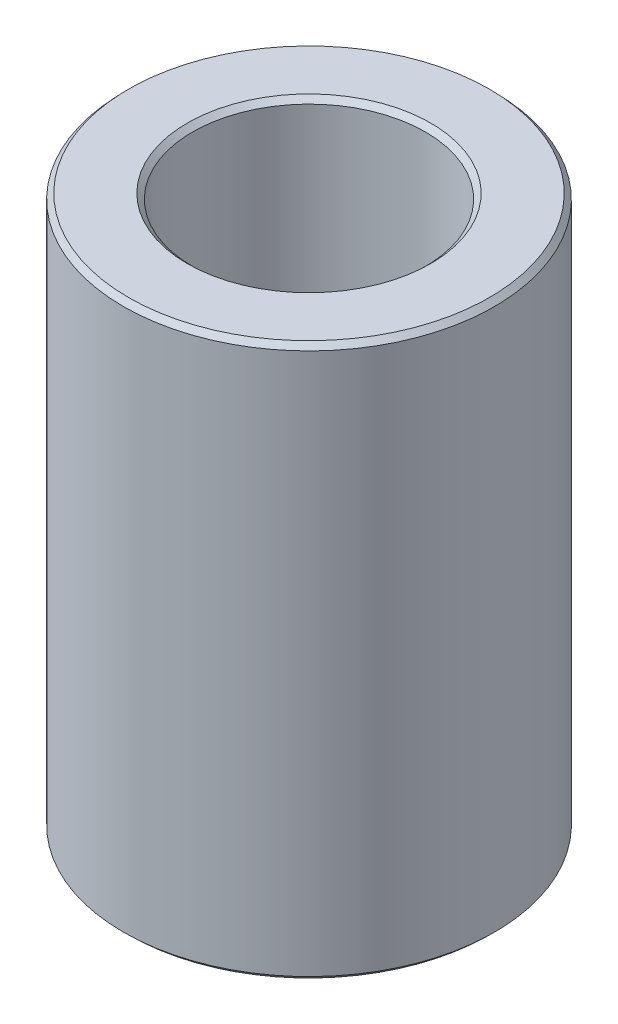
ISO-10303-21;
HEADER;
FILE_DESCRIPTION(('STEP AP214'),'2;1');
FILE_NAME('part.step','',(''),(''),'','','');
FILE_SCHEMA(('AUTOMOTIVE_DESIGN { 1 0 10303 214 1 1 1 1 }'));
ENDSEC;
DATA;
#1=APPLICATION_CONTEXT('core data for automotive mechanical design processes');
#2=APPLICATION_PROTOCOL_DEFINITION('international standard','automotive_design',2000,#1);
#3=PRODUCT_CONTEXT('',#1,'mechanical');
#4=PRODUCT('Part','Part','',(#3));
#5=PRODUCT_RELATED_PRODUCT_CATEGORY('part','',(#4));
#6=PRODUCT_DEFINITION_FORMATION('','',#4);
#7=PRODUCT_DEFINITION_CONTEXT('part definition',#1,'design');
#8=PRODUCT_DEFINITION('design','',#6,#7);
#9=PRODUCT_DEFINITION_SHAPE('','',#8);
#10=(LENGTH_UNIT() NAMED_UNIT(*) SI_UNIT(.MILLI.,.METRE.));
#11=(NAMED_UNIT(*) PLANE_ANGLE_UNIT() SI_UNIT($,.RADIAN.));
#12=(NAMED_UNIT(*) SI_UNIT($,.STERADIAN.) SOLID_ANGLE_UNIT());
#13=UNCERTAINTY_MEASURE_WITH_UNIT(LENGTH_MEASURE(1.E-05),#10,'distance_accuracy_value','');
#14=(GEOMETRIC_REPRESENTATION_CONTEXT(3) GLOBAL_UNCERTAINTY_ASSIGNED_CONTEXT((#13)) GLOBAL_UNIT_ASSIGNED_CONTEXT((#10,
#11,#12)) REPRESENTATION_CONTEXT('',''));
#15=CARTESIAN_POINT('',(0.,0.,0.));
#16=DIRECTION('',(0.,0.,1.));
#17=DIRECTION('',(1.,0.,0.));
#18=AXIS2_PLACEMENT_3D('',#15,#16,#17);
#19=CARTESIAN_POINT('',(0.,104.165975308789,0.));
#20=DIRECTION('',(0.,-1.,0.));
#21=DIRECTION('',(0.,0.,-1.));
#22=AXIS2_PLACEMENT_3D('',#19,#20,#21);
#23=CYLINDRICAL_SURFACE('',#22,35.);
#24=CARTESIAN_POINT('',(0.,0.952306027105845,0.));
#25=DIRECTION('',(0.,1.,0.));
#26=DIRECTION('',(0.,0.,1.));
#27=AXIS2_PLACEMENT_3D('',#24,#25,#26);
#28=CIRCLE('',#27,35.);
#29=CARTESIAN_POINT('',(0.,0.952306027105845,-35.));
#30=VERTEX_POINT('',#29);
#31=EDGE_CURVE('E10',#30,#30,#28,.T.);
#32=CARTESIAN_POINT('',(0.,103.164212017992,0.));
#33=DIRECTION('',(0.,1.,0.));
#34=DIRECTION('',(0.,0.,1.));
#35=AXIS2_PLACEMENT_3D('',#32,#33,#34);
#36=CIRCLE('',#35,35.);
#37=CARTESIAN_POINT('',(0.,103.164212017992,-35.));
#38=VERTEX_POINT('',#37);
#39=EDGE_CURVE('E50',#38,#38,#36,.F.);
#40=CARTESIAN_POINT('',(0.,0.952306027105845,-35.));
#41=CARTESIAN_POINT('',(0.,2.01701338117758,-35.));
#42=CARTESIAN_POINT('',(0.,3.08172073524932,-35.));
#43=CARTESIAN_POINT('',(0.,5.21113544339279,-35.));
#44=CARTESIAN_POINT('',(0.,6.27584279746452,-35.));
#45=CARTESIAN_POINT('',(0.,8.405257505608,-35.));
#46=CARTESIAN_POINT('',(0.,9.46996485967973,-35.));
#47=CARTESIAN_POINT('',(0.,11.5993795678232,-35.));
#48=CARTESIAN_POINT('',(0.,12.6640869218949,-35.));
#49=CARTESIAN_POINT('',(0.,14.7935016300384,-35.));
#50=CARTESIAN_POINT('',(0.,15.8582089841101,-35.));
#51=CARTESIAN_POINT('',(0.,17.9876236922536,-35.));
#52=CARTESIAN_POINT('',(0.,19.0523310463254,-35.));
#53=CARTESIAN_POINT('',(0.,21.1817457544688,-35.));
#54=CARTESIAN_POINT('',(0.,22.2464531085406,-35.));
#55=CARTESIAN_POINT('',(0.,24.375867816684,-35.));
#56=CARTESIAN_POINT('',(0.,25.4405751707558,-35.));
#57=CARTESIAN_POINT('',(0.,27.5699898788992,-35.));
#58=CARTESIAN_POINT('',(0.,28.634697232971,-35.));
#59=CARTESIAN_POINT('',(0.,30.7641119411144,-35.));
#60=CARTESIAN_POINT('',(0.,31.8288192951862,-35.));
#61=CARTESIAN_POINT('',(0.,33.9582340033297,-35.));
#62=CARTESIAN_POINT('',(0.,35.0229413574014,-35.));
#63=CARTESIAN_POINT('',(0.,37.1523560655449,-35.));
#64=CARTESIAN_POINT('',(0.,38.2170634196166,-35.));
#65=CARTESIAN_POINT('',(0.,40.3464781277601,-35.));
#66=CARTESIAN_POINT('',(0.,41.4111854818318,-35.));
#67=CARTESIAN_POINT('',(0.,43.5406001899753,-35.));
#68=CARTESIAN_POINT('',(0.,44.605307544047,-35.));
#69=CARTESIAN_POINT('',(0.,46.7347222521905,-35.));
#70=CARTESIAN_POINT('',(0.,47.7994296062622,-35.));
#71=CARTESIAN_POINT('',(0.,49.9288443144057,-35.));
#72=CARTESIAN_POINT('',(0.,50.9935516684774,-35.));
#73=CARTESIAN_POINT('',(0.,53.1229663766209,-35.));
#74=CARTESIAN_POINT('',(0.,54.1876737306926,-35.));
#75=CARTESIAN_POINT('',(0.,56.3170884388361,-35.));
#76=CARTESIAN_POINT('',(0.,57.3817957929078,-35.));
#77=CARTESIAN_POINT('',(0.,59.5112105010513,-35.));
#78=CARTESIAN_POINT('',(0.,60.575917855123,-35.));
#79=CARTESIAN_POINT('',(0.,62.7053325632665,-35.));
#80=CARTESIAN_POINT('',(0.,63.7700399173382,-35.));
#81=CARTESIAN_POINT('',(0.,65.8994546254817,-35.));
#82=CARTESIAN_POINT('',(0.,66.9641619795535,-35.));
#83=CARTESIAN_POINT('',(0.,69.0935766876969,-35.));
#84=CARTESIAN_POINT('',(0.,70.1582840417686,-35.));
#85=CARTESIAN_POINT('',(0.,72.2876987499121,-35.));
#86=CARTESIAN_POINT('',(0.,73.3524061039838,-35.));
#87=CARTESIAN_POINT('',(0.,75.4818208121273,-35.));
#88=CARTESIAN_POINT('',(0.,76.5465281661991,-35.));
#89=CARTESIAN_POINT('',(0.,78.6759428743425,-35.));
#90=CARTESIAN_POINT('',(0.,79.7406502284143,-35.));
#91=CARTESIAN_POINT('',(0.,81.8700649365577,-35.));
#92=CARTESIAN_POINT('',(0.,82.9347722906295,-35.));
#93=CARTESIAN_POINT('',(0.,85.0641869987729,-35.));
#94=CARTESIAN_POINT('',(0.,86.1288943528447,-35.));
#95=CARTESIAN_POINT('',(0.,88.2583090609882,-35.));
#96=CARTESIAN_POINT('',(0.,89.3230164150599,-35.));
#97=CARTESIAN_POINT('',(0.,91.4524311232034,-35.));
#98=CARTESIAN_POINT('',(0.,92.5171384772751,-35.));
#99=CARTESIAN_POINT('',(0.,94.6465531854186,-35.));
#100=CARTESIAN_POINT('',(0.,95.7112605394903,-35.));
#101=CARTESIAN_POINT('',(0.,97.8406752476338,-35.));
#102=CARTESIAN_POINT('',(0.,98.9053826017055,-35.));
#103=CARTESIAN_POINT('',(0.,101.034797309849,-35.));
#104=CARTESIAN_POINT('',(0.,102.099504663921,-35.));
#105=CARTESIAN_POINT('',(0.,103.164212017992,-35.));
#106=B_SPLINE_CURVE_WITH_KNOTS('',3,(#40,#41,#42,#43,#44,#45,#46,#47,#48,#49,#50,#51,#52,#53,
#54,#55,#56,#57,#58,#59,#60,#61,#62,#63,#64,#65,#66,#67,#68,#69,#70,#71,#72,#73,#74,#75,#76,#77,
#78,#79,#80,#81,#82,#83,#84,#85,#86,#87,#88,#89,#90,#91,#92,#93,#94,#95,#96,#97,#98,#99,#100,
#101,#102,#103,#104,#105),.UNSPECIFIED.,.F.,.F.,(4,2,2,2,2,2,2,2,2,2,2,2,2,2,2,2,2,2,2,2,2,2,2,
2,2,2,2,2,2,2,2,2,4),(0.,3.19412206221521,6.38824412443041,9.58236618664562,12.7764882488608,
15.970610311076,19.1647323732912,22.3588544355064,25.5529764977216,28.7470985599369,
31.9412206221521,35.1353426843673,38.3294647465825,41.5235868087977,44.7177088710129,
47.9118309332281,51.1059529954433,54.3000750576585,57.4941971198737,60.6883191820889,
63.8824412443041,67.0765633065193,70.2706853687345,73.4648074309497,76.6589294931649,
79.8530515553801,83.0471736175954,86.2412956798106,89.4354177420258,92.629539804241,
95.8236618664562,99.0177839286714,102.211905990887),.UNSPECIFIED.);
#107=EDGE_CURVE('BSEAM39',#30,#38,#106,.T.);
#108=ORIENTED_EDGE('',*,*,#31,.T.);
#109=ORIENTED_EDGE('',*,*,#39,.T.);
#110=ORIENTED_EDGE('',*,*,#107,.T.);
#111=ORIENTED_EDGE('',*,*,#107,.F.);
#112=EDGE_LOOP('',(#108,#110,#109,#111));
#113=FACE_BOUND('',#112,.T.);
#114=ADVANCED_FACE('F39',(#113),#23,.T.);
#115=CARTESIAN_POINT('',(0.,104.165975308789,0.));
#116=DIRECTION('',(0.,1.,0.));
#117=DIRECTION('',(0.,0.,1.));
#118=AXIS2_PLACEMENT_3D('',#115,#116,#117);
#119=PLANE('',#118);
#120=CARTESIAN_POINT('',(0.,104.165975308789,0.));
#121=DIRECTION('',(0.,1.,0.));
#122=DIRECTION('',(0.,0.,1.));
#123=AXIS2_PLACEMENT_3D('',#120,#121,#122);
#124=CIRCLE('',#123,22.9690660415909);
#125=CARTESIAN_POINT('',(0.,104.165975308789,22.9690660415909));
#126=VERTEX_POINT('',#125);
#127=EDGE_CURVE('E58',#126,#126,#124,.F.);
#128=ORIENTED_EDGE('',*,*,#127,.T.);
#129=EDGE_LOOP('',(#128));
#130=FACE_BOUND('',#129,.T.);
#131=CARTESIAN_POINT('',(0.,104.165975308789,0.));
#132=DIRECTION('',(0.,1.,0.));
#133=DIRECTION('',(0.,0.,1.));
#134=AXIS2_PLACEMENT_3D('',#131,#132,#133);
#135=CIRCLE('',#134,34.0476939728944);
#136=CARTESIAN_POINT('',(0.,104.165975308789,34.0476939728944));
#137=VERTEX_POINT('',#136);
#138=EDGE_CURVE('E61',#137,#137,#135,.T.);
#139=ORIENTED_EDGE('',*,*,#138,.T.);
#140=EDGE_LOOP('',(#139));
#141=FACE_BOUND('',#140,.T.);
#142=ADVANCED_FACE('F88',(#130,#141),#119,.T.);
#143=CARTESIAN_POINT('',(0.,0.,0.));
#144=DIRECTION('',(0.,1.,0.));
#145=DIRECTION('',(0.,0.,1.));
#146=AXIS2_PLACEMENT_3D('',#143,#144,#145);
#147=PLANE('',#146);
#148=CARTESIAN_POINT('',(0.,0.,0.));
#149=DIRECTION('',(0.,1.,0.));
#150=DIRECTION('',(0.,0.,1.));
#151=AXIS2_PLACEMENT_3D('',#148,#149,#150);
#152=CIRCLE('',#151,22.9196087778997);
#153=CARTESIAN_POINT('',(0.,0.,22.9196087778997));
#154=VERTEX_POINT('',#153);
#155=EDGE_CURVE('E51',#154,#154,#152,.T.);
#156=ORIENTED_EDGE('',*,*,#155,.T.);
#157=EDGE_LOOP('',(#156));
#158=FACE_BOUND('',#157,.T.);
#159=CARTESIAN_POINT('',(0.,0.,0.));
#160=DIRECTION('',(0.,1.,0.));
#161=DIRECTION('',(0.,0.,1.));
#162=AXIS2_PLACEMENT_3D('',#159,#160,#161);
#163=CIRCLE('',#162,33.998236709203);
#164=CARTESIAN_POINT('',(0.,0.,33.998236709203));
#165=VERTEX_POINT('',#164);
#166=EDGE_CURVE('E54',#165,#165,#163,.F.);
#167=ORIENTED_EDGE('',*,*,#166,.T.);
#168=EDGE_LOOP('',(#167));
#169=FACE_BOUND('',#168,.T.);
#170=ADVANCED_FACE('F83',(#158,#169),#147,.F.);
#171=CARTESIAN_POINT('',(0.,104.165975308789,0.));
#172=DIRECTION('',(0.,-1.,0.));
#173=DIRECTION('',(0.,0.,-1.));
#174=AXIS2_PLACEMENT_3D('',#171,#172,#173);
#175=CYLINDRICAL_SURFACE('',#174,21.9673027507939);
#176=CARTESIAN_POINT('',(0.,103.213669281683,0.));
#177=DIRECTION('',(0.,1.,0.));
#178=DIRECTION('',(0.,0.,1.));
#179=AXIS2_PLACEMENT_3D('',#176,#177,#178);
#180=CIRCLE('',#179,21.9673027507939);
#181=CARTESIAN_POINT('',(0.,103.213669281683,-21.9673027507939));
#182=VERTEX_POINT('',#181);
#183=EDGE_CURVE('E67',#182,#182,#180,.T.);
#184=CARTESIAN_POINT('',(0.,1.00176329079686,0.));
#185=DIRECTION('',(0.,1.,0.));
#186=DIRECTION('',(0.,0.,1.));
#187=AXIS2_PLACEMENT_3D('',#184,#185,#186);
#188=CIRCLE('',#187,21.9673027507939);
#189=CARTESIAN_POINT('',(0.,1.00176329079686,-21.9673027507939));
#190=VERTEX_POINT('',#189);
#191=EDGE_CURVE('E69',#190,#190,#188,.F.);
#192=CARTESIAN_POINT('',(0.,103.213669281683,-21.9673027507939));
#193=CARTESIAN_POINT('',(0.,102.148961927612,-21.9673027507939));
#194=CARTESIAN_POINT('',(0.,101.08425457354,-21.9673027507939));
#195=CARTESIAN_POINT('',(0.,98.9548398653964,-21.9673027507939));
#196=CARTESIAN_POINT('',(0.,97.8901325113247,-21.9673027507939));
#197=CARTESIAN_POINT('',(0.,95.7607178031812,-21.9673027507939));
#198=CARTESIAN_POINT('',(0.,94.6960104491095,-21.9673027507939));
#199=CARTESIAN_POINT('',(0.,92.566595740966,-21.9673027507939));
#200=CARTESIAN_POINT('',(0.,91.5018883868943,-21.9673027507939));
#201=CARTESIAN_POINT('',(0.,89.3724736787508,-21.9673027507939));
#202=CARTESIAN_POINT('',(0.,88.3077663246791,-21.9673027507939));
#203=CARTESIAN_POINT('',(0.,86.1783516165356,-21.9673027507939));
#204=CARTESIAN_POINT('',(0.,85.1136442624639,-21.9673027507939));
#205=CARTESIAN_POINT('',(0.,82.9842295543204,-21.9673027507939));
#206=CARTESIAN_POINT('',(0.,81.9195222002487,-21.9673027507939));
#207=CARTESIAN_POINT('',(0.,79.7901074921052,-21.9673027507939));
#208=CARTESIAN_POINT('',(0.,78.7254001380335,-21.9673027507939));
#209=CARTESIAN_POINT('',(0.,76.59598542989,-21.9673027507939));
#210=CARTESIAN_POINT('',(0.,75.5312780758183,-21.9673027507939));
#211=CARTESIAN_POINT('',(0.,73.4018633676748,-21.9673027507939));
#212=CARTESIAN_POINT('',(0.,72.3371560136031,-21.9673027507939));
#213=CARTESIAN_POINT('',(0.,70.2077413054596,-21.9673027507939));
#214=CARTESIAN_POINT('',(0.,69.1430339513879,-21.9673027507939));
#215=CARTESIAN_POINT('',(0.,67.0136192432444,-21.9673027507939));
#216=CARTESIAN_POINT('',(0.,65.9489118891727,-21.9673027507939));
#217=CARTESIAN_POINT('',(0.,63.8194971810292,-21.9673027507939));
#218=CARTESIAN_POINT('',(0.,62.7547898269574,-21.9673027507939));
#219=CARTESIAN_POINT('',(0.,60.625375118814,-21.9673027507939));
#220=CARTESIAN_POINT('',(0.,59.5606677647423,-21.9673027507939));
#221=CARTESIAN_POINT('',(0.,57.4312530565988,-21.9673027507939));
#222=CARTESIAN_POINT('',(0.,56.3665457025271,-21.9673027507939));
#223=CARTESIAN_POINT('',(0.,54.2371309943836,-21.9673027507939));
#224=CARTESIAN_POINT('',(0.,53.1724236403118,-21.9673027507939));
#225=CARTESIAN_POINT('',(0.,51.0430089321684,-21.9673027507939));
#226=CARTESIAN_POINT('',(0.,49.9783015780966,-21.9673027507939));
#227=CARTESIAN_POINT('',(0.,47.8488868699532,-21.9673027507939));
#228=CARTESIAN_POINT('',(0.,46.7841795158814,-21.9673027507939));
#229=CARTESIAN_POINT('',(0.,44.654764807738,-21.9673027507939));
#230=CARTESIAN_POINT('',(0.,43.5900574536662,-21.9673027507939));
#231=CARTESIAN_POINT('',(0.,41.4606427455228,-21.9673027507939));
#232=CARTESIAN_POINT('',(0.,40.395935391451,-21.9673027507939));
#233=CARTESIAN_POINT('',(0.,38.2665206833076,-21.9673027507939));
#234=CARTESIAN_POINT('',(0.,37.2018133292358,-21.9673027507939));
#235=CARTESIAN_POINT('',(0.,35.0723986210924,-21.9673027507939));
#236=CARTESIAN_POINT('',(0.,34.0076912670206,-21.9673027507939));
#237=CARTESIAN_POINT('',(0.,31.8782765588772,-21.9673027507939));
#238=CARTESIAN_POINT('',(0.,30.8135692048054,-21.9673027507939));
#239=CARTESIAN_POINT('',(0.,28.684154496662,-21.9673027507939));
#240=CARTESIAN_POINT('',(0.,27.6194471425902,-21.9673027507939));
#241=CARTESIAN_POINT('',(0.,25.4900324344467,-21.9673027507939));
#242=CARTESIAN_POINT('',(0.,24.425325080375,-21.9673027507939));
#243=CARTESIAN_POINT('',(0.,22.2959103722315,-21.9673027507939));
#244=CARTESIAN_POINT('',(0.,21.2312030181598,-21.9673027507939));
#245=CARTESIAN_POINT('',(0.,19.1017883100163,-21.9673027507939));
#246=CARTESIAN_POINT('',(0.,18.0370809559446,-21.9673027507939));
#247=CARTESIAN_POINT('',(0.,15.9076662478012,-21.9673027507939));
#248=CARTESIAN_POINT('',(0.,14.8429588937294,-21.9673027507939));
#249=CARTESIAN_POINT('',(0.,12.713544185586,-21.9673027507939));
#250=CARTESIAN_POINT('',(0.,11.6488368315142,-21.9673027507939));
#251=CARTESIAN_POINT('',(0.,9.51942212337075,-21.9673027507939));
#252=CARTESIAN_POINT('',(0.,8.45471476929902,-21.9673027507939));
#253=CARTESIAN_POINT('',(0.,6.32530006115554,-21.9673027507939));
#254=CARTESIAN_POINT('',(0.,5.2605927070838,-21.9673027507939));
#255=CARTESIAN_POINT('',(0.,3.13117799894033,-21.9673027507939));
#256=CARTESIAN_POINT('',(0.,2.06647064486859,-21.9673027507939));
#257=CARTESIAN_POINT('',(0.,1.00176329079686,-21.9673027507939));
#258=B_SPLINE_CURVE_WITH_KNOTS('',3,(#192,#193,#194,#195,#196,#197,#198,#199,#200,#201,#202,
#203,#204,#205,#206,#207,#208,#209,#210,#211,#212,#213,#214,#215,#216,#217,#218,#219,#220,#221,
#222,#223,#224,#225,#226,#227,#228,#229,#230,#231,#232,#233,#234,#235,#236,#237,#238,#239,#240,
#241,#242,#243,#244,#245,#246,#247,#248,#249,#250,#251,#252,#253,#254,#255,#256,#257),
.UNSPECIFIED.,.F.,.F.,(4,2,2,2,2,2,2,2,2,2,2,2,2,2,2,2,2,2,2,2,2,2,2,2,2,2,2,2,2,2,2,2,4),(0.,
3.19412206221521,6.38824412443041,9.58236618664561,12.7764882488608,15.970610311076,
19.1647323732912,22.3588544355064,25.5529764977216,28.7470985599368,31.941220622152,
35.1353426843672,38.3294647465824,41.5235868087976,44.7177088710128,47.911830933228,
51.1059529954433,54.3000750576585,57.4941971198737,60.6883191820889,63.8824412443041,
67.0765633065193,70.2706853687345,73.4648074309497,76.6589294931649,79.8530515553801,
83.0471736175953,86.2412956798105,89.4354177420257,92.6295398042409,95.8236618664561,
99.0177839286713,102.211905990887),.UNSPECIFIED.);
#259=EDGE_CURVE('BSEAM71',#182,#190,#258,.T.);
#260=ORIENTED_EDGE('',*,*,#183,.T.);
#261=ORIENTED_EDGE('',*,*,#191,.T.);
#262=ORIENTED_EDGE('',*,*,#259,.T.);
#263=ORIENTED_EDGE('',*,*,#259,.F.);
#264=EDGE_LOOP('',(#260,#262,#261,#263));
#265=FACE_BOUND('',#264,.T.);
#266=ADVANCED_FACE('F71',(#265),#175,.F.);
#267=CARTESIAN_POINT('',(0.,103.213669281683,0.));
#268=DIRECTION('',(0.,1.,0.));
#269=DIRECTION('',(0.,0.,1.));
#270=AXIS2_PLACEMENT_3D('',#267,#268,#269);
#271=CONICAL_SURFACE('',#270,21.9673027507939,0.810702642969236);
#272=ORIENTED_EDGE('',*,*,#127,.F.);
#273=EDGE_LOOP('',(#272));
#274=FACE_BOUND('',#273,.T.);
#275=ORIENTED_EDGE('',*,*,#183,.F.);
#276=EDGE_LOOP('',(#275));
#277=FACE_BOUND('',#276,.T.);
#278=ADVANCED_FACE('F77',(#274,#277),#271,.F.);
#279=CARTESIAN_POINT('',(0.,0.,0.));
#280=DIRECTION('',(0.,-1.,0.));
#281=DIRECTION('',(0.,0.,-1.));
#282=AXIS2_PLACEMENT_3D('',#279,#280,#281);
#283=CONICAL_SURFACE('',#282,22.9196087778997,0.760093683825652);
#284=ORIENTED_EDGE('',*,*,#191,.F.);
#285=EDGE_LOOP('',(#284));
#286=FACE_BOUND('',#285,.T.);
#287=ORIENTED_EDGE('',*,*,#155,.F.);
#288=EDGE_LOOP('',(#287));
#289=FACE_BOUND('',#288,.T.);
#290=ADVANCED_FACE('F73',(#286,#289),#283,.F.);
#291=CARTESIAN_POINT('',(0.,0.952306027105845,0.));
#292=DIRECTION('',(0.,1.,0.));
#293=DIRECTION('',(0.,0.,1.));
#294=AXIS2_PLACEMENT_3D('',#291,#292,#293);
#295=CONICAL_SURFACE('',#294,35.,0.810702642969239);
#296=ORIENTED_EDGE('',*,*,#166,.F.);
#297=EDGE_LOOP('',(#296));
#298=FACE_BOUND('',#297,.T.);
#299=ORIENTED_EDGE('',*,*,#31,.F.);
#300=EDGE_LOOP('',(#299));
#301=FACE_BOUND('',#300,.T.);
#302=ADVANCED_FACE('F76',(#298,#301),#295,.T.);
#303=CARTESIAN_POINT('',(0.,104.165975308789,0.));
#304=DIRECTION('',(0.,-1.,0.));
#305=DIRECTION('',(0.,0.,-1.));
#306=AXIS2_PLACEMENT_3D('',#303,#304,#305);
#307=CONICAL_SURFACE('',#306,34.0476939728944,0.760093683825646);
#308=ORIENTED_EDGE('',*,*,#39,.F.);
#309=EDGE_LOOP('',(#308));
#310=FACE_BOUND('',#309,.T.);
#311=ORIENTED_EDGE('',*,*,#138,.F.);
#312=EDGE_LOOP('',(#311));
#313=FACE_BOUND('',#312,.T.);
#314=ADVANCED_FACE('F45',(#310,#313),#307,.T.);
#315=CLOSED_SHELL('',(#114,#142,#170,#266,#278,#290,#302,#314));
#316=MANIFOLD_SOLID_BREP('B2',#315);
#317=ADVANCED_BREP_SHAPE_REPRESENTATION('',(#18,#316),#14);
#318=SHAPE_DEFINITION_REPRESENTATION(#9,#317);
ENDSEC;
END-ISO-10303-21;
